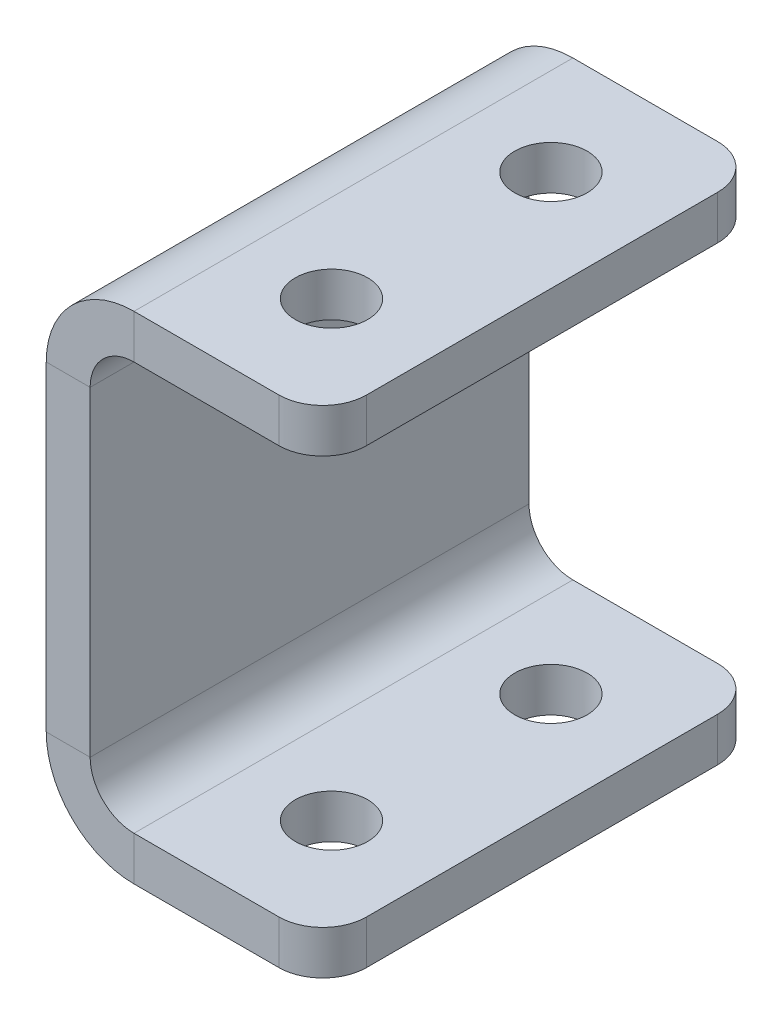
ISO-10303-21;
HEADER;
FILE_DESCRIPTION(('STEP AP214'),'2;1');
FILE_NAME('part.step','',(''),(''),'','','');
FILE_SCHEMA(('AUTOMOTIVE_DESIGN { 1 0 10303 214 1 1 1 1 }'));
ENDSEC;
DATA;
#1=APPLICATION_CONTEXT('core data for automotive mechanical design processes');
#2=APPLICATION_PROTOCOL_DEFINITION('international standard','automotive_design',2000,#1);
#3=PRODUCT_CONTEXT('',#1,'mechanical');
#4=PRODUCT('Part','Part','',(#3));
#5=PRODUCT_RELATED_PRODUCT_CATEGORY('part','',(#4));
#6=PRODUCT_DEFINITION_FORMATION('','',#4);
#7=PRODUCT_DEFINITION_CONTEXT('part definition',#1,'design');
#8=PRODUCT_DEFINITION('design','',#6,#7);
#9=PRODUCT_DEFINITION_SHAPE('','',#8);
#10=(LENGTH_UNIT() NAMED_UNIT(*) SI_UNIT(.MILLI.,.METRE.));
#11=(NAMED_UNIT(*) PLANE_ANGLE_UNIT() SI_UNIT($,.RADIAN.));
#12=(NAMED_UNIT(*) SI_UNIT($,.STERADIAN.) SOLID_ANGLE_UNIT());
#13=UNCERTAINTY_MEASURE_WITH_UNIT(LENGTH_MEASURE(1.E-05),#10,'distance_accuracy_value','');
#14=(GEOMETRIC_REPRESENTATION_CONTEXT(3) GLOBAL_UNCERTAINTY_ASSIGNED_CONTEXT((#13)) GLOBAL_UNIT_ASSIGNED_CONTEXT((#10,
#11,#12)) REPRESENTATION_CONTEXT('',''));
#15=CARTESIAN_POINT('',(0.,0.,0.));
#16=DIRECTION('',(0.,0.,1.));
#17=DIRECTION('',(1.,0.,0.));
#18=AXIS2_PLACEMENT_3D('',#15,#16,#17);
#19=CARTESIAN_POINT('',(0.,-36.5,50.));
#20=DIRECTION('',(0.,0.,1.));
#21=DIRECTION('',(1.,0.,0.));
#22=AXIS2_PLACEMENT_3D('',#19,#20,#21);
#23=PLANE('',#22);
#24=DIRECTION('',(1.,0.,0.));
#25=VECTOR('',#24,1.);
#26=CARTESIAN_POINT('',(0.,-36.5,50.));
#27=LINE('',#26,#25);
#28=CARTESIAN_POINT('',(0.,-36.5,50.));
#29=VERTEX_POINT('',#28);
#30=CARTESIAN_POINT('',(10.,-36.5,50.));
#31=VERTEX_POINT('',#30);
#32=EDGE_CURVE('E274',#29,#31,#27,.T.);
#33=ORIENTED_EDGE('',*,*,#32,.F.);
#34=CARTESIAN_POINT('',(20.,-36.5,50.));
#35=DIRECTION('',(0.,0.,1.));
#36=DIRECTION('',(1.,0.,0.));
#37=AXIS2_PLACEMENT_3D('',#34,#35,#36);
#38=CIRCLE('',#37,20.);
#39=CARTESIAN_POINT('',(20.,-56.5,50.));
#40=VERTEX_POINT('',#39);
#41=EDGE_CURVE('E191',#40,#29,#38,.F.);
#42=ORIENTED_EDGE('',*,*,#41,.F.);
#43=DIRECTION('',(0.,-1.,0.));
#44=VECTOR('',#43,1.);
#45=CARTESIAN_POINT('',(20.,-46.5,50.));
#46=LINE('',#45,#44);
#47=CARTESIAN_POINT('',(20.,-46.5,50.));
#48=VERTEX_POINT('',#47);
#49=EDGE_CURVE('E271',#48,#40,#46,.T.);
#50=ORIENTED_EDGE('',*,*,#49,.F.);
#51=CARTESIAN_POINT('',(20.,-36.5,50.));
#52=DIRECTION('',(0.,0.,1.));
#53=DIRECTION('',(1.,0.,0.));
#54=AXIS2_PLACEMENT_3D('',#51,#52,#53);
#55=CIRCLE('',#54,10.);
#56=EDGE_CURVE('E201',#48,#31,#55,.F.);
#57=ORIENTED_EDGE('',*,*,#56,.T.);
#58=EDGE_LOOP('',(#33,#42,#50,#57));
#59=FACE_BOUND('',#58,.T.);
#60=ADVANCED_FACE('F41',(#59),#23,.T.);
#61=CARTESIAN_POINT('',(20.,-46.5,50.));
#62=DIRECTION('',(0.,0.,1.));
#63=DIRECTION('',(1.,0.,0.));
#64=AXIS2_PLACEMENT_3D('',#61,#62,#63);
#65=PLANE('',#64);
#66=DIRECTION('',(0.,1.,0.));
#67=VECTOR('',#66,1.);
#68=CARTESIAN_POINT('',(0.,56.5,50.));
#69=LINE('',#68,#67);
#70=CARTESIAN_POINT('',(0.,36.5,50.));
#71=VERTEX_POINT('',#70);
#72=EDGE_CURVE('E189',#29,#71,#69,.T.);
#73=ORIENTED_EDGE('',*,*,#72,.F.);
#74=ORIENTED_EDGE('',*,*,#32,.T.);
#75=DIRECTION('',(0.,1.,0.));
#76=VECTOR('',#75,1.);
#77=CARTESIAN_POINT('',(9.99999999999998,56.5,50.));
#78=LINE('',#77,#76);
#79=CARTESIAN_POINT('',(9.99999999999998,36.5,50.));
#80=VERTEX_POINT('',#79);
#81=EDGE_CURVE('E204',#31,#80,#78,.T.);
#82=ORIENTED_EDGE('',*,*,#81,.T.);
#83=DIRECTION('',(-1.,0.,0.));
#84=VECTOR('',#83,1.);
#85=CARTESIAN_POINT('',(9.99999999999998,36.5,50.));
#86=LINE('',#85,#84);
#87=EDGE_CURVE('E166',#80,#71,#86,.T.);
#88=ORIENTED_EDGE('',*,*,#87,.T.);
#89=EDGE_LOOP('',(#73,#74,#82,#88));
#90=FACE_BOUND('',#89,.T.);
#91=ADVANCED_FACE('F427',(#90),#65,.T.);
#92=CARTESIAN_POINT('',(20.,-56.5,-50.));
#93=DIRECTION('',(0.,0.,-1.));
#94=DIRECTION('',(-1.,0.,0.));
#95=AXIS2_PLACEMENT_3D('',#92,#93,#94);
#96=PLANE('',#95);
#97=DIRECTION('',(0.,1.,0.));
#98=VECTOR('',#97,1.);
#99=CARTESIAN_POINT('',(20.,-56.5,-50.));
#100=LINE('',#99,#98);
#101=CARTESIAN_POINT('',(20.,-56.5,-50.));
#102=VERTEX_POINT('',#101);
#103=CARTESIAN_POINT('',(20.,-46.5,-50.));
#104=VERTEX_POINT('',#103);
#105=EDGE_CURVE('E268',#102,#104,#100,.T.);
#106=ORIENTED_EDGE('',*,*,#105,.F.);
#107=CARTESIAN_POINT('',(20.,-36.5,-50.));
#108=DIRECTION('',(0.,0.,1.));
#109=DIRECTION('',(1.,0.,0.));
#110=AXIS2_PLACEMENT_3D('',#107,#108,#109);
#111=CIRCLE('',#110,20.);
#112=CARTESIAN_POINT('',(0.,-36.5,-50.));
#113=VERTEX_POINT('',#112);
#114=EDGE_CURVE('E219',#102,#113,#111,.F.);
#115=ORIENTED_EDGE('',*,*,#114,.T.);
#116=DIRECTION('',(-1.,0.,0.));
#117=VECTOR('',#116,1.);
#118=CARTESIAN_POINT('',(10.,-36.5,-50.));
#119=LINE('',#118,#117);
#120=CARTESIAN_POINT('',(10.,-36.5,-50.));
#121=VERTEX_POINT('',#120);
#122=EDGE_CURVE('E165',#121,#113,#119,.T.);
#123=ORIENTED_EDGE('',*,*,#122,.F.);
#124=CARTESIAN_POINT('',(20.,-36.5,-50.));
#125=DIRECTION('',(0.,0.,1.));
#126=DIRECTION('',(1.,0.,0.));
#127=AXIS2_PLACEMENT_3D('',#124,#125,#126);
#128=CIRCLE('',#127,10.);
#129=EDGE_CURVE('E226',#104,#121,#128,.F.);
#130=ORIENTED_EDGE('',*,*,#129,.F.);
#131=EDGE_LOOP('',(#106,#115,#123,#130));
#132=FACE_BOUND('',#131,.T.);
#133=ADVANCED_FACE('F393',(#132),#96,.T.);
#134=CARTESIAN_POINT('',(10.,-36.5,-50.));
#135=DIRECTION('',(0.,0.,-1.));
#136=DIRECTION('',(-1.,0.,0.));
#137=AXIS2_PLACEMENT_3D('',#134,#135,#136);
#138=PLANE('',#137);
#139=DIRECTION('',(-1.,0.,0.));
#140=VECTOR('',#139,1.);
#141=CARTESIAN_POINT('',(0.,-46.5,-50.));
#142=LINE('',#141,#140);
#143=CARTESIAN_POINT('',(53.,-46.5,-50.));
#144=VERTEX_POINT('',#143);
#145=EDGE_CURVE('E224',#144,#104,#142,.T.);
#146=ORIENTED_EDGE('',*,*,#145,.F.);
#147=DIRECTION('',(0.,-1.,0.));
#148=VECTOR('',#147,1.);
#149=CARTESIAN_POINT('',(53.,-36.5000000000001,-50.));
#150=LINE('',#149,#148);
#151=CARTESIAN_POINT('',(53.,-56.5,-50.));
#152=VERTEX_POINT('',#151);
#153=EDGE_CURVE('E300',#144,#152,#150,.T.);
#154=ORIENTED_EDGE('',*,*,#153,.T.);
#155=DIRECTION('',(-1.,0.,0.));
#156=VECTOR('',#155,1.);
#157=CARTESIAN_POINT('',(0.,-56.5,-50.));
#158=LINE('',#157,#156);
#159=EDGE_CURVE('E222',#152,#102,#158,.T.);
#160=ORIENTED_EDGE('',*,*,#159,.T.);
#161=ORIENTED_EDGE('',*,*,#105,.T.);
#162=EDGE_LOOP('',(#146,#154,#160,#161));
#163=FACE_BOUND('',#162,.T.);
#164=ADVANCED_FACE('F387',(#163),#138,.T.);
#165=CARTESIAN_POINT('',(20.,56.5,50.));
#166=DIRECTION('',(0.,0.,1.));
#167=DIRECTION('',(1.,0.,0.));
#168=AXIS2_PLACEMENT_3D('',#165,#166,#167);
#169=PLANE('',#168);
#170=DIRECTION('',(0.,-1.,0.));
#171=VECTOR('',#170,1.);
#172=CARTESIAN_POINT('',(20.,56.5,50.));
#173=LINE('',#172,#171);
#174=CARTESIAN_POINT('',(20.,56.5,50.));
#175=VERTEX_POINT('',#174);
#176=CARTESIAN_POINT('',(20.,46.5,50.));
#177=VERTEX_POINT('',#176);
#178=EDGE_CURVE('E156',#175,#177,#173,.T.);
#179=ORIENTED_EDGE('',*,*,#178,.F.);
#180=CARTESIAN_POINT('',(20.,36.5,50.));
#181=DIRECTION('',(0.,0.,1.));
#182=DIRECTION('',(1.,0.,0.));
#183=AXIS2_PLACEMENT_3D('',#180,#181,#182);
#184=CIRCLE('',#183,20.);
#185=EDGE_CURVE('E160',#71,#175,#184,.F.);
#186=ORIENTED_EDGE('',*,*,#185,.F.);
#187=ORIENTED_EDGE('',*,*,#87,.F.);
#188=CARTESIAN_POINT('',(20.,36.5,50.));
#189=DIRECTION('',(0.,0.,1.));
#190=DIRECTION('',(1.,0.,0.));
#191=AXIS2_PLACEMENT_3D('',#188,#189,#190);
#192=CIRCLE('',#191,10.);
#193=EDGE_CURVE('E163',#80,#177,#192,.F.);
#194=ORIENTED_EDGE('',*,*,#193,.T.);
#195=EDGE_LOOP('',(#179,#186,#187,#194));
#196=FACE_BOUND('',#195,.T.);
#197=ADVANCED_FACE('F158',(#196),#169,.T.);
#198=CARTESIAN_POINT('',(9.99999999999998,36.5,50.));
#199=DIRECTION('',(0.,0.,1.));
#200=DIRECTION('',(1.,0.,0.));
#201=AXIS2_PLACEMENT_3D('',#198,#199,#200);
#202=PLANE('',#201);
#203=DIRECTION('',(1.,0.,0.));
#204=VECTOR('',#203,1.);
#205=CARTESIAN_POINT('',(0.,46.5,50.));
#206=LINE('',#205,#204);
#207=CARTESIAN_POINT('',(53.,46.5,50.));
#208=VERTEX_POINT('',#207);
#209=EDGE_CURVE('E184',#177,#208,#206,.T.);
#210=ORIENTED_EDGE('',*,*,#209,.T.);
#211=DIRECTION('',(0.,-1.,0.));
#212=VECTOR('',#211,1.);
#213=CARTESIAN_POINT('',(53.,36.5000000000001,50.));
#214=LINE('',#213,#212);
#215=CARTESIAN_POINT('',(53.,56.5,50.));
#216=VERTEX_POINT('',#215);
#217=EDGE_CURVE('E11',#208,#216,#214,.F.);
#218=ORIENTED_EDGE('',*,*,#217,.T.);
#219=DIRECTION('',(1.,0.,0.));
#220=VECTOR('',#219,1.);
#221=CARTESIAN_POINT('',(0.,56.5,50.));
#222=LINE('',#221,#220);
#223=EDGE_CURVE('E173',#175,#216,#222,.T.);
#224=ORIENTED_EDGE('',*,*,#223,.F.);
#225=ORIENTED_EDGE('',*,*,#178,.T.);
#226=EDGE_LOOP('',(#210,#218,#224,#225));
#227=FACE_BOUND('',#226,.T.);
#228=ADVANCED_FACE('F183',(#227),#202,.T.);
#229=CARTESIAN_POINT('',(0.,36.5,-50.));
#230=DIRECTION('',(0.,0.,-1.));
#231=DIRECTION('',(-1.,0.,0.));
#232=AXIS2_PLACEMENT_3D('',#229,#230,#231);
#233=PLANE('',#232);
#234=DIRECTION('',(1.,0.,0.));
#235=VECTOR('',#234,1.);
#236=CARTESIAN_POINT('',(0.,36.5,-50.));
#237=LINE('',#236,#235);
#238=CARTESIAN_POINT('',(0.,36.5,-50.));
#239=VERTEX_POINT('',#238);
#240=CARTESIAN_POINT('',(9.99999999999998,36.5,-50.));
#241=VERTEX_POINT('',#240);
#242=EDGE_CURVE('E264',#239,#241,#237,.T.);
#243=ORIENTED_EDGE('',*,*,#242,.F.);
#244=CARTESIAN_POINT('',(20.,36.5,-50.));
#245=DIRECTION('',(0.,0.,1.));
#246=DIRECTION('',(1.,0.,0.));
#247=AXIS2_PLACEMENT_3D('',#244,#245,#246);
#248=CIRCLE('',#247,20.);
#249=CARTESIAN_POINT('',(20.,56.5,-50.));
#250=VERTEX_POINT('',#249);
#251=EDGE_CURVE('E214',#239,#250,#248,.F.);
#252=ORIENTED_EDGE('',*,*,#251,.T.);
#253=DIRECTION('',(0.,1.,0.));
#254=VECTOR('',#253,1.);
#255=CARTESIAN_POINT('',(20.,46.5,-50.));
#256=LINE('',#255,#254);
#257=CARTESIAN_POINT('',(20.,46.5,-50.));
#258=VERTEX_POINT('',#257);
#259=EDGE_CURVE('E262',#258,#250,#256,.T.);
#260=ORIENTED_EDGE('',*,*,#259,.F.);
#261=CARTESIAN_POINT('',(20.,36.5,-50.));
#262=DIRECTION('',(0.,0.,1.));
#263=DIRECTION('',(1.,0.,0.));
#264=AXIS2_PLACEMENT_3D('',#261,#262,#263);
#265=CIRCLE('',#264,10.);
#266=EDGE_CURVE('E232',#241,#258,#265,.F.);
#267=ORIENTED_EDGE('',*,*,#266,.F.);
#268=EDGE_LOOP('',(#243,#252,#260,#267));
#269=FACE_BOUND('',#268,.T.);
#270=ADVANCED_FACE('F408',(#269),#233,.T.);
#271=CARTESIAN_POINT('',(20.,46.5,-50.));
#272=DIRECTION('',(0.,0.,-1.));
#273=DIRECTION('',(-1.,0.,0.));
#274=AXIS2_PLACEMENT_3D('',#271,#272,#273);
#275=PLANE('',#274);
#276=DIRECTION('',(0.,1.,0.));
#277=VECTOR('',#276,1.);
#278=CARTESIAN_POINT('',(0.,56.5,-50.));
#279=LINE('',#278,#277);
#280=EDGE_CURVE('E216',#113,#239,#279,.T.);
#281=ORIENTED_EDGE('',*,*,#280,.T.);
#282=ORIENTED_EDGE('',*,*,#242,.T.);
#283=DIRECTION('',(0.,1.,0.));
#284=VECTOR('',#283,1.);
#285=CARTESIAN_POINT('',(9.99999999999998,56.5,-50.));
#286=LINE('',#285,#284);
#287=EDGE_CURVE('E229',#121,#241,#286,.T.);
#288=ORIENTED_EDGE('',*,*,#287,.F.);
#289=ORIENTED_EDGE('',*,*,#122,.T.);
#290=EDGE_LOOP('',(#281,#282,#288,#289));
#291=FACE_BOUND('',#290,.T.);
#292=ADVANCED_FACE('F397',(#291),#275,.T.);
#293=CARTESIAN_POINT('',(0.,46.5,50.));
#294=DIRECTION('',(0.,1.,0.));
#295=DIRECTION('',(-1.,0.,0.));
#296=AXIS2_PLACEMENT_3D('',#293,#294,#295);
#297=PLANE('',#296);
#298=CARTESIAN_POINT('',(40.,46.5,25.));
#299=DIRECTION('',(0.,1.,0.));
#300=DIRECTION('',(-1.,0.,0.));
#301=AXIS2_PLACEMENT_3D('',#298,#299,#300);
#302=CIRCLE('',#301,8.25);
#303=CARTESIAN_POINT('',(31.75,46.5,25.));
#304=VERTEX_POINT('',#303);
#305=EDGE_CURVE('E284',#304,#304,#302,.T.);
#306=ORIENTED_EDGE('',*,*,#305,.T.);
#307=EDGE_LOOP('',(#306));
#308=FACE_BOUND('',#307,.T.);
#309=CARTESIAN_POINT('',(40.,46.5,-25.));
#310=DIRECTION('',(0.,1.,0.));
#311=DIRECTION('',(-1.,0.,0.));
#312=AXIS2_PLACEMENT_3D('',#309,#310,#311);
#313=CIRCLE('',#312,8.25);
#314=CARTESIAN_POINT('',(31.75,46.5,-25.));
#315=VERTEX_POINT('',#314);
#316=EDGE_CURVE('E212',#315,#315,#313,.T.);
#317=ORIENTED_EDGE('',*,*,#316,.T.);
#318=EDGE_LOOP('',(#317));
#319=FACE_BOUND('',#318,.T.);
#320=DIRECTION('',(1.,0.,0.));
#321=VECTOR('',#320,1.);
#322=CARTESIAN_POINT('',(0.,46.5,-50.));
#323=LINE('',#322,#321);
#324=CARTESIAN_POINT('',(53.,46.5,-50.));
#325=VERTEX_POINT('',#324);
#326=EDGE_CURVE('E209',#258,#325,#323,.T.);
#327=ORIENTED_EDGE('',*,*,#326,.T.);
#328=CARTESIAN_POINT('',(53.,46.5,-40.));
#329=DIRECTION('',(0.,1.,0.));
#330=DIRECTION('',(-1.,0.,0.));
#331=AXIS2_PLACEMENT_3D('',#328,#329,#330);
#332=CIRCLE('',#331,10.);
#333=CARTESIAN_POINT('',(63.,46.5,-40.));
#334=VERTEX_POINT('',#333);
#335=EDGE_CURVE('E308',#325,#334,#332,.F.);
#336=ORIENTED_EDGE('',*,*,#335,.T.);
#337=DIRECTION('',(0.,0.,-1.));
#338=VECTOR('',#337,1.);
#339=CARTESIAN_POINT('',(63.,46.5,50.));
#340=LINE('',#339,#338);
#341=CARTESIAN_POINT('',(63.,46.5,40.));
#342=VERTEX_POINT('',#341);
#343=EDGE_CURVE('E260',#342,#334,#340,.T.);
#344=ORIENTED_EDGE('',*,*,#343,.F.);
#345=CARTESIAN_POINT('',(53.,46.5,40.));
#346=DIRECTION('',(0.,1.,0.));
#347=DIRECTION('',(-1.,0.,0.));
#348=AXIS2_PLACEMENT_3D('',#345,#346,#347);
#349=CIRCLE('',#348,10.);
#350=EDGE_CURVE('E306',#342,#208,#349,.F.);
#351=ORIENTED_EDGE('',*,*,#350,.T.);
#352=ORIENTED_EDGE('',*,*,#209,.F.);
#353=DIRECTION('',(0.,0.,-1.));
#354=VECTOR('',#353,1.);
#355=CARTESIAN_POINT('',(20.,46.5,50.));
#356=LINE('',#355,#354);
#357=EDGE_CURVE('E208',#177,#258,#356,.T.);
#358=ORIENTED_EDGE('',*,*,#357,.T.);
#359=EDGE_LOOP('',(#327,#336,#344,#351,#352,#358));
#360=FACE_BOUND('',#359,.T.);
#361=ADVANCED_FACE('F324',(#308,#319,#360),#297,.F.);
#362=CARTESIAN_POINT('',(63.,56.5,50.));
#363=DIRECTION('',(1.,0.,0.));
#364=DIRECTION('',(0.,1.,0.));
#365=AXIS2_PLACEMENT_3D('',#362,#363,#364);
#366=PLANE('',#365);
#367=ORIENTED_EDGE('',*,*,#343,.T.);
#368=DIRECTION('',(0.,-1.,0.));
#369=VECTOR('',#368,1.);
#370=CARTESIAN_POINT('',(63.,56.5,-40.));
#371=LINE('',#370,#369);
#372=CARTESIAN_POINT('',(63.,56.5,-40.));
#373=VERTEX_POINT('',#372);
#374=EDGE_CURVE('E62',#334,#373,#371,.F.);
#375=ORIENTED_EDGE('',*,*,#374,.T.);
#376=DIRECTION('',(0.,0.,-1.));
#377=VECTOR('',#376,1.);
#378=CARTESIAN_POINT('',(63.,56.5,50.));
#379=LINE('',#378,#377);
#380=CARTESIAN_POINT('',(63.,56.5,40.));
#381=VERTEX_POINT('',#380);
#382=EDGE_CURVE('E180',#381,#373,#379,.T.);
#383=ORIENTED_EDGE('',*,*,#382,.F.);
#384=DIRECTION('',(0.,-1.,0.));
#385=VECTOR('',#384,1.);
#386=CARTESIAN_POINT('',(63.,56.5,40.));
#387=LINE('',#386,#385);
#388=EDGE_CURVE('E310',#381,#342,#387,.T.);
#389=ORIENTED_EDGE('',*,*,#388,.T.);
#390=EDGE_LOOP('',(#367,#375,#383,#389));
#391=FACE_BOUND('',#390,.T.);
#392=ADVANCED_FACE('F325',(#391),#366,.T.);
#393=CARTESIAN_POINT('',(0.,56.5,50.));
#394=DIRECTION('',(0.,1.,0.));
#395=DIRECTION('',(-1.,0.,0.));
#396=AXIS2_PLACEMENT_3D('',#393,#394,#395);
#397=PLANE('',#396);
#398=CARTESIAN_POINT('',(40.,56.5,25.));
#399=DIRECTION('',(0.,1.,0.));
#400=DIRECTION('',(-1.,0.,0.));
#401=AXIS2_PLACEMENT_3D('',#398,#399,#400);
#402=CIRCLE('',#401,8.25);
#403=CARTESIAN_POINT('',(31.75,56.5,25.));
#404=VERTEX_POINT('',#403);
#405=EDGE_CURVE('E339',#404,#404,#402,.T.);
#406=ORIENTED_EDGE('',*,*,#405,.F.);
#407=EDGE_LOOP('',(#406));
#408=FACE_BOUND('',#407,.T.);
#409=CARTESIAN_POINT('',(40.,56.5,-25.));
#410=DIRECTION('',(0.,1.,0.));
#411=DIRECTION('',(-1.,0.,0.));
#412=AXIS2_PLACEMENT_3D('',#409,#410,#411);
#413=CIRCLE('',#412,8.25);
#414=CARTESIAN_POINT('',(31.75,56.5,-25.));
#415=VERTEX_POINT('',#414);
#416=EDGE_CURVE('E332',#415,#415,#413,.T.);
#417=ORIENTED_EDGE('',*,*,#416,.F.);
#418=EDGE_LOOP('',(#417));
#419=FACE_BOUND('',#418,.T.);
#420=ORIENTED_EDGE('',*,*,#382,.T.);
#421=CARTESIAN_POINT('',(53.,56.5,-40.));
#422=DIRECTION('',(0.,1.,0.));
#423=DIRECTION('',(-1.,0.,0.));
#424=AXIS2_PLACEMENT_3D('',#421,#422,#423);
#425=CIRCLE('',#424,10.);
#426=CARTESIAN_POINT('',(53.,56.5,-50.));
#427=VERTEX_POINT('',#426);
#428=EDGE_CURVE('E49',#373,#427,#425,.T.);
#429=ORIENTED_EDGE('',*,*,#428,.T.);
#430=DIRECTION('',(1.,0.,0.));
#431=VECTOR('',#430,1.);
#432=CARTESIAN_POINT('',(0.,56.5,-50.));
#433=LINE('',#432,#431);
#434=EDGE_CURVE('E176',#250,#427,#433,.T.);
#435=ORIENTED_EDGE('',*,*,#434,.F.);
#436=DIRECTION('',(0.,0.,-1.));
#437=VECTOR('',#436,1.);
#438=CARTESIAN_POINT('',(20.,56.5,50.));
#439=LINE('',#438,#437);
#440=EDGE_CURVE('E171',#175,#250,#439,.T.);
#441=ORIENTED_EDGE('',*,*,#440,.F.);
#442=ORIENTED_EDGE('',*,*,#223,.T.);
#443=CARTESIAN_POINT('',(53.,56.5,40.));
#444=DIRECTION('',(0.,1.,0.));
#445=DIRECTION('',(-1.,0.,0.));
#446=AXIS2_PLACEMENT_3D('',#443,#444,#445);
#447=CIRCLE('',#446,10.);
#448=EDGE_CURVE('E314',#216,#381,#447,.T.);
#449=ORIENTED_EDGE('',*,*,#448,.T.);
#450=EDGE_LOOP('',(#420,#429,#435,#441,#442,#449));
#451=FACE_BOUND('',#450,.T.);
#452=ADVANCED_FACE('F172',(#408,#419,#451),#397,.T.);
#453=CARTESIAN_POINT('',(20.,36.5,50.));
#454=DIRECTION('',(0.,0.,-1.));
#455=DIRECTION('',(-1.,0.,0.));
#456=AXIS2_PLACEMENT_3D('',#453,#454,#455);
#457=CYLINDRICAL_SURFACE('',#456,20.);
#458=ORIENTED_EDGE('',*,*,#251,.F.);
#459=DIRECTION('',(0.,0.,-1.));
#460=VECTOR('',#459,1.);
#461=CARTESIAN_POINT('',(0.,36.5,50.));
#462=LINE('',#461,#460);
#463=EDGE_CURVE('E181',#71,#239,#462,.T.);
#464=ORIENTED_EDGE('',*,*,#463,.F.);
#465=ORIENTED_EDGE('',*,*,#185,.T.);
#466=ORIENTED_EDGE('',*,*,#440,.T.);
#467=EDGE_LOOP('',(#458,#464,#465,#466));
#468=FACE_BOUND('',#467,.T.);
#469=ADVANCED_FACE('F187',(#468),#457,.T.);
#470=CARTESIAN_POINT('',(0.,56.5,50.));
#471=DIRECTION('',(-1.,0.,0.));
#472=DIRECTION('',(0.,-1.,0.));
#473=AXIS2_PLACEMENT_3D('',#470,#471,#472);
#474=PLANE('',#473);
#475=ORIENTED_EDGE('',*,*,#280,.F.);
#476=DIRECTION('',(0.,0.,-1.));
#477=VECTOR('',#476,1.);
#478=CARTESIAN_POINT('',(0.,-36.5,50.));
#479=LINE('',#478,#477);
#480=EDGE_CURVE('E255',#29,#113,#479,.T.);
#481=ORIENTED_EDGE('',*,*,#480,.F.);
#482=ORIENTED_EDGE('',*,*,#72,.T.);
#483=ORIENTED_EDGE('',*,*,#463,.T.);
#484=EDGE_LOOP('',(#475,#481,#482,#483));
#485=FACE_BOUND('',#484,.T.);
#486=ADVANCED_FACE('F406',(#485),#474,.T.);
#487=CARTESIAN_POINT('',(20.,-36.5,50.));
#488=DIRECTION('',(0.,0.,-1.));
#489=DIRECTION('',(-1.,0.,0.));
#490=AXIS2_PLACEMENT_3D('',#487,#488,#489);
#491=CYLINDRICAL_SURFACE('',#490,20.);
#492=ORIENTED_EDGE('',*,*,#114,.F.);
#493=DIRECTION('',(0.,0.,-1.));
#494=VECTOR('',#493,1.);
#495=CARTESIAN_POINT('',(20.,-56.5,50.));
#496=LINE('',#495,#494);
#497=EDGE_CURVE('E252',#40,#102,#496,.T.);
#498=ORIENTED_EDGE('',*,*,#497,.F.);
#499=ORIENTED_EDGE('',*,*,#41,.T.);
#500=ORIENTED_EDGE('',*,*,#480,.T.);
#501=EDGE_LOOP('',(#492,#498,#499,#500));
#502=FACE_BOUND('',#501,.T.);
#503=ADVANCED_FACE('F401',(#502),#491,.T.);
#504=CARTESIAN_POINT('',(0.,-56.5,50.));
#505=DIRECTION('',(0.,-1.,0.));
#506=DIRECTION('',(1.,0.,0.));
#507=AXIS2_PLACEMENT_3D('',#504,#505,#506);
#508=PLANE('',#507);
#509=CARTESIAN_POINT('',(40.,-56.5,25.));
#510=DIRECTION('',(0.,1.,0.));
#511=DIRECTION('',(-1.,0.,0.));
#512=AXIS2_PLACEMENT_3D('',#509,#510,#511);
#513=CIRCLE('',#512,8.25);
#514=CARTESIAN_POINT('',(31.75,-56.5,25.));
#515=VERTEX_POINT('',#514);
#516=EDGE_CURVE('E285',#515,#515,#513,.T.);
#517=ORIENTED_EDGE('',*,*,#516,.T.);
#518=EDGE_LOOP('',(#517));
#519=FACE_BOUND('',#518,.T.);
#520=CARTESIAN_POINT('',(40.,-56.5,-25.));
#521=DIRECTION('',(0.,1.,0.));
#522=DIRECTION('',(-1.,0.,0.));
#523=AXIS2_PLACEMENT_3D('',#520,#521,#522);
#524=CIRCLE('',#523,8.25);
#525=CARTESIAN_POINT('',(31.75,-56.5,-25.));
#526=VERTEX_POINT('',#525);
#527=EDGE_CURVE('E280',#526,#526,#524,.T.);
#528=ORIENTED_EDGE('',*,*,#527,.T.);
#529=EDGE_LOOP('',(#528));
#530=FACE_BOUND('',#529,.T.);
#531=DIRECTION('',(0.,0.,-1.));
#532=VECTOR('',#531,1.);
#533=CARTESIAN_POINT('',(63.,-56.5,50.));
#534=LINE('',#533,#532);
#535=CARTESIAN_POINT('',(63.,-56.5,40.));
#536=VERTEX_POINT('',#535);
#537=CARTESIAN_POINT('',(63.,-56.5,-40.));
#538=VERTEX_POINT('',#537);
#539=EDGE_CURVE('E249',#536,#538,#534,.T.);
#540=ORIENTED_EDGE('',*,*,#539,.F.);
#541=CARTESIAN_POINT('',(53.,-56.5,40.));
#542=DIRECTION('',(0.,-1.,0.));
#543=DIRECTION('',(1.,0.,0.));
#544=AXIS2_PLACEMENT_3D('',#541,#542,#543);
#545=CIRCLE('',#544,10.);
#546=CARTESIAN_POINT('',(53.,-56.5,50.));
#547=VERTEX_POINT('',#546);
#548=EDGE_CURVE('E292',#536,#547,#545,.T.);
#549=ORIENTED_EDGE('',*,*,#548,.T.);
#550=DIRECTION('',(-1.,0.,0.));
#551=VECTOR('',#550,1.);
#552=CARTESIAN_POINT('',(0.,-56.5,50.));
#553=LINE('',#552,#551);
#554=EDGE_CURVE('E197',#547,#40,#553,.T.);
#555=ORIENTED_EDGE('',*,*,#554,.T.);
#556=ORIENTED_EDGE('',*,*,#497,.T.);
#557=ORIENTED_EDGE('',*,*,#159,.F.);
#558=CARTESIAN_POINT('',(53.,-56.5,-40.));
#559=DIRECTION('',(0.,-1.,0.));
#560=DIRECTION('',(1.,0.,0.));
#561=AXIS2_PLACEMENT_3D('',#558,#559,#560);
#562=CIRCLE('',#561,10.);
#563=EDGE_CURVE('E290',#152,#538,#562,.T.);
#564=ORIENTED_EDGE('',*,*,#563,.T.);
#565=EDGE_LOOP('',(#540,#549,#555,#556,#557,#564));
#566=FACE_BOUND('',#565,.T.);
#567=ADVANCED_FACE('F345',(#519,#530,#566),#508,.T.);
#568=CARTESIAN_POINT('',(63.,-46.5,50.));
#569=DIRECTION('',(1.,0.,0.));
#570=DIRECTION('',(0.,1.,0.));
#571=AXIS2_PLACEMENT_3D('',#568,#569,#570);
#572=PLANE('',#571);
#573=DIRECTION('',(0.,0.,-1.));
#574=VECTOR('',#573,1.);
#575=CARTESIAN_POINT('',(63.,-46.5,50.));
#576=LINE('',#575,#574);
#577=CARTESIAN_POINT('',(63.,-46.5,40.));
#578=VERTEX_POINT('',#577);
#579=CARTESIAN_POINT('',(63.,-46.5,-40.));
#580=VERTEX_POINT('',#579);
#581=EDGE_CURVE('E246',#578,#580,#576,.T.);
#582=ORIENTED_EDGE('',*,*,#581,.F.);
#583=DIRECTION('',(0.,-1.,0.));
#584=VECTOR('',#583,1.);
#585=CARTESIAN_POINT('',(63.,-46.5,40.));
#586=LINE('',#585,#584);
#587=EDGE_CURVE('E287',#578,#536,#586,.T.);
#588=ORIENTED_EDGE('',*,*,#587,.T.);
#589=ORIENTED_EDGE('',*,*,#539,.T.);
#590=DIRECTION('',(0.,-1.,0.));
#591=VECTOR('',#590,1.);
#592=CARTESIAN_POINT('',(63.,-46.5,-40.));
#593=LINE('',#592,#591);
#594=EDGE_CURVE('E276',#538,#580,#593,.F.);
#595=ORIENTED_EDGE('',*,*,#594,.T.);
#596=EDGE_LOOP('',(#582,#588,#589,#595));
#597=FACE_BOUND('',#596,.T.);
#598=ADVANCED_FACE('F360',(#597),#572,.T.);
#599=CARTESIAN_POINT('',(0.,-46.5,50.));
#600=DIRECTION('',(0.,-1.,0.));
#601=DIRECTION('',(1.,0.,0.));
#602=AXIS2_PLACEMENT_3D('',#599,#600,#601);
#603=PLANE('',#602);
#604=CARTESIAN_POINT('',(40.,-46.5,25.));
#605=DIRECTION('',(0.,-1.,0.));
#606=DIRECTION('',(1.,0.,0.));
#607=AXIS2_PLACEMENT_3D('',#604,#605,#606);
#608=CIRCLE('',#607,8.25);
#609=CARTESIAN_POINT('',(48.25,-46.5,25.));
#610=VERTEX_POINT('',#609);
#611=EDGE_CURVE('E281',#610,#610,#608,.T.);
#612=ORIENTED_EDGE('',*,*,#611,.T.);
#613=EDGE_LOOP('',(#612));
#614=FACE_BOUND('',#613,.T.);
#615=CARTESIAN_POINT('',(40.,-46.5,-25.));
#616=DIRECTION('',(0.,-1.,0.));
#617=DIRECTION('',(1.,0.,0.));
#618=AXIS2_PLACEMENT_3D('',#615,#616,#617);
#619=CIRCLE('',#618,8.25);
#620=CARTESIAN_POINT('',(48.25,-46.5,-25.));
#621=VERTEX_POINT('',#620);
#622=EDGE_CURVE('E277',#621,#621,#619,.T.);
#623=ORIENTED_EDGE('',*,*,#622,.T.);
#624=EDGE_LOOP('',(#623));
#625=FACE_BOUND('',#624,.T.);
#626=DIRECTION('',(-1.,0.,0.));
#627=VECTOR('',#626,1.);
#628=CARTESIAN_POINT('',(0.,-46.5,50.));
#629=LINE('',#628,#627);
#630=CARTESIAN_POINT('',(53.,-46.5,50.));
#631=VERTEX_POINT('',#630);
#632=EDGE_CURVE('E199',#631,#48,#629,.T.);
#633=ORIENTED_EDGE('',*,*,#632,.F.);
#634=CARTESIAN_POINT('',(53.,-46.5,40.));
#635=DIRECTION('',(0.,-1.,0.));
#636=DIRECTION('',(1.,0.,0.));
#637=AXIS2_PLACEMENT_3D('',#634,#635,#636);
#638=CIRCLE('',#637,10.);
#639=EDGE_CURVE('E298',#631,#578,#638,.F.);
#640=ORIENTED_EDGE('',*,*,#639,.T.);
#641=ORIENTED_EDGE('',*,*,#581,.T.);
#642=CARTESIAN_POINT('',(53.,-46.5,-40.));
#643=DIRECTION('',(0.,-1.,0.));
#644=DIRECTION('',(1.,0.,0.));
#645=AXIS2_PLACEMENT_3D('',#642,#643,#644);
#646=CIRCLE('',#645,10.);
#647=EDGE_CURVE('E296',#580,#144,#646,.F.);
#648=ORIENTED_EDGE('',*,*,#647,.T.);
#649=ORIENTED_EDGE('',*,*,#145,.T.);
#650=DIRECTION('',(0.,0.,-1.));
#651=VECTOR('',#650,1.);
#652=CARTESIAN_POINT('',(20.,-46.5,50.));
#653=LINE('',#652,#651);
#654=EDGE_CURVE('E243',#48,#104,#653,.T.);
#655=ORIENTED_EDGE('',*,*,#654,.F.);
#656=EDGE_LOOP('',(#633,#640,#641,#648,#649,#655));
#657=FACE_BOUND('',#656,.T.);
#658=ADVANCED_FACE('F356',(#614,#625,#657),#603,.F.);
#659=CARTESIAN_POINT('',(20.,-36.5,50.));
#660=DIRECTION('',(0.,0.,-1.));
#661=DIRECTION('',(-1.,0.,0.));
#662=AXIS2_PLACEMENT_3D('',#659,#660,#661);
#663=CYLINDRICAL_SURFACE('',#662,10.);
#664=ORIENTED_EDGE('',*,*,#129,.T.);
#665=DIRECTION('',(0.,0.,-1.));
#666=VECTOR('',#665,1.);
#667=CARTESIAN_POINT('',(10.,-36.5,50.));
#668=LINE('',#667,#666);
#669=EDGE_CURVE('E240',#31,#121,#668,.T.);
#670=ORIENTED_EDGE('',*,*,#669,.F.);
#671=ORIENTED_EDGE('',*,*,#56,.F.);
#672=ORIENTED_EDGE('',*,*,#654,.T.);
#673=EDGE_LOOP('',(#664,#670,#671,#672));
#674=FACE_BOUND('',#673,.T.);
#675=ADVANCED_FACE('F359',(#674),#663,.F.);
#676=CARTESIAN_POINT('',(9.99999999999998,56.5,50.));
#677=DIRECTION('',(-1.,0.,0.));
#678=DIRECTION('',(0.,-1.,0.));
#679=AXIS2_PLACEMENT_3D('',#676,#677,#678);
#680=PLANE('',#679);
#681=ORIENTED_EDGE('',*,*,#287,.T.);
#682=DIRECTION('',(0.,0.,-1.));
#683=VECTOR('',#682,1.);
#684=CARTESIAN_POINT('',(9.99999999999998,36.5,50.));
#685=LINE('',#684,#683);
#686=EDGE_CURVE('E237',#80,#241,#685,.T.);
#687=ORIENTED_EDGE('',*,*,#686,.F.);
#688=ORIENTED_EDGE('',*,*,#81,.F.);
#689=ORIENTED_EDGE('',*,*,#669,.T.);
#690=EDGE_LOOP('',(#681,#687,#688,#689));
#691=FACE_BOUND('',#690,.T.);
#692=ADVANCED_FACE('F412',(#691),#680,.F.);
#693=CARTESIAN_POINT('',(20.,36.5,50.));
#694=DIRECTION('',(0.,0.,-1.));
#695=DIRECTION('',(-1.,0.,0.));
#696=AXIS2_PLACEMENT_3D('',#693,#694,#695);
#697=CYLINDRICAL_SURFACE('',#696,10.);
#698=ORIENTED_EDGE('',*,*,#266,.T.);
#699=ORIENTED_EDGE('',*,*,#357,.F.);
#700=ORIENTED_EDGE('',*,*,#193,.F.);
#701=ORIENTED_EDGE('',*,*,#686,.T.);
#702=EDGE_LOOP('',(#698,#699,#700,#701));
#703=FACE_BOUND('',#702,.T.);
#704=ADVANCED_FACE('F415',(#703),#697,.F.);
#705=CARTESIAN_POINT('',(20.,36.5,50.));
#706=DIRECTION('',(0.,0.,1.));
#707=DIRECTION('',(1.,0.,0.));
#708=AXIS2_PLACEMENT_3D('',#705,#706,#707);
#709=PLANE('',#708);
#710=ORIENTED_EDGE('',*,*,#554,.F.);
#711=DIRECTION('',(0.,-1.,0.));
#712=VECTOR('',#711,1.);
#713=CARTESIAN_POINT('',(53.0000000000001,36.5,50.));
#714=LINE('',#713,#712);
#715=EDGE_CURVE('E294',#547,#631,#714,.F.);
#716=ORIENTED_EDGE('',*,*,#715,.T.);
#717=ORIENTED_EDGE('',*,*,#632,.T.);
#718=ORIENTED_EDGE('',*,*,#49,.T.);
#719=EDGE_LOOP('',(#710,#716,#717,#718));
#720=FACE_BOUND('',#719,.T.);
#721=ADVANCED_FACE('F417',(#720),#709,.T.);
#722=CARTESIAN_POINT('',(20.,36.5,-50.));
#723=DIRECTION('',(0.,0.,1.));
#724=DIRECTION('',(1.,0.,0.));
#725=AXIS2_PLACEMENT_3D('',#722,#723,#724);
#726=PLANE('',#725);
#727=ORIENTED_EDGE('',*,*,#434,.T.);
#728=DIRECTION('',(0.,-1.,0.));
#729=VECTOR('',#728,1.);
#730=CARTESIAN_POINT('',(53.,46.5,-50.));
#731=LINE('',#730,#729);
#732=EDGE_CURVE('E303',#427,#325,#731,.T.);
#733=ORIENTED_EDGE('',*,*,#732,.T.);
#734=ORIENTED_EDGE('',*,*,#326,.F.);
#735=ORIENTED_EDGE('',*,*,#259,.T.);
#736=EDGE_LOOP('',(#727,#733,#734,#735));
#737=FACE_BOUND('',#736,.T.);
#738=ADVANCED_FACE('F319',(#737),#726,.F.);
#739=CARTESIAN_POINT('',(40.,-56.5,-25.));
#740=DIRECTION('',(0.,1.,0.));
#741=DIRECTION('',(-1.,0.,0.));
#742=AXIS2_PLACEMENT_3D('',#739,#740,#741);
#743=CYLINDRICAL_SURFACE('',#742,8.25);
#744=ORIENTED_EDGE('',*,*,#527,.F.);
#745=EDGE_LOOP('',(#744));
#746=FACE_BOUND('',#745,.T.);
#747=ORIENTED_EDGE('',*,*,#622,.F.);
#748=EDGE_LOOP('',(#747));
#749=FACE_BOUND('',#748,.T.);
#750=ADVANCED_FACE('F473',(#746,#749),#743,.F.);
#751=ORIENTED_EDGE('',*,*,#416,.T.);
#752=EDGE_LOOP('',(#751));
#753=FACE_BOUND('',#752,.T.);
#754=ORIENTED_EDGE('',*,*,#316,.F.);
#755=EDGE_LOOP('',(#754));
#756=FACE_BOUND('',#755,.T.);
#757=ADVANCED_FACE('F352',(#753,#756),#743,.F.);
#758=CARTESIAN_POINT('',(40.,-56.5,25.));
#759=DIRECTION('',(0.,1.,0.));
#760=DIRECTION('',(-1.,0.,0.));
#761=AXIS2_PLACEMENT_3D('',#758,#759,#760);
#762=CYLINDRICAL_SURFACE('',#761,8.25);
#763=ORIENTED_EDGE('',*,*,#516,.F.);
#764=EDGE_LOOP('',(#763));
#765=FACE_BOUND('',#764,.T.);
#766=ORIENTED_EDGE('',*,*,#611,.F.);
#767=EDGE_LOOP('',(#766));
#768=FACE_BOUND('',#767,.T.);
#769=ADVANCED_FACE('F348',(#765,#768),#762,.F.);
#770=ORIENTED_EDGE('',*,*,#405,.T.);
#771=EDGE_LOOP('',(#770));
#772=FACE_BOUND('',#771,.T.);
#773=ORIENTED_EDGE('',*,*,#305,.F.);
#774=EDGE_LOOP('',(#773));
#775=FACE_BOUND('',#774,.T.);
#776=ADVANCED_FACE('F351',(#772,#775),#762,.F.);
#777=CARTESIAN_POINT('',(53.,-46.5,40.));
#778=DIRECTION('',(0.,-1.,0.));
#779=DIRECTION('',(1.,0.,0.));
#780=AXIS2_PLACEMENT_3D('',#777,#778,#779);
#781=CYLINDRICAL_SURFACE('',#780,10.);
#782=ORIENTED_EDGE('',*,*,#639,.F.);
#783=ORIENTED_EDGE('',*,*,#715,.F.);
#784=ORIENTED_EDGE('',*,*,#548,.F.);
#785=ORIENTED_EDGE('',*,*,#587,.F.);
#786=EDGE_LOOP('',(#782,#783,#784,#785));
#787=FACE_BOUND('',#786,.T.);
#788=ADVANCED_FACE('F374',(#787),#781,.T.);
#789=CARTESIAN_POINT('',(53.,-36.5000000000001,-40.));
#790=DIRECTION('',(0.,-1.,0.));
#791=DIRECTION('',(1.,0.,0.));
#792=AXIS2_PLACEMENT_3D('',#789,#790,#791);
#793=CYLINDRICAL_SURFACE('',#792,10.);
#794=ORIENTED_EDGE('',*,*,#647,.F.);
#795=ORIENTED_EDGE('',*,*,#594,.F.);
#796=ORIENTED_EDGE('',*,*,#563,.F.);
#797=ORIENTED_EDGE('',*,*,#153,.F.);
#798=EDGE_LOOP('',(#794,#795,#796,#797));
#799=FACE_BOUND('',#798,.T.);
#800=ADVANCED_FACE('F384',(#799),#793,.T.);
#801=CARTESIAN_POINT('',(53.,36.5000000000001,-40.));
#802=DIRECTION('',(0.,1.,0.));
#803=DIRECTION('',(-1.,0.,0.));
#804=AXIS2_PLACEMENT_3D('',#801,#802,#803);
#805=CYLINDRICAL_SURFACE('',#804,10.);
#806=ORIENTED_EDGE('',*,*,#428,.F.);
#807=ORIENTED_EDGE('',*,*,#374,.F.);
#808=ORIENTED_EDGE('',*,*,#335,.F.);
#809=ORIENTED_EDGE('',*,*,#732,.F.);
#810=EDGE_LOOP('',(#806,#807,#808,#809));
#811=FACE_BOUND('',#810,.T.);
#812=ADVANCED_FACE('F321',(#811),#805,.T.);
#813=CARTESIAN_POINT('',(53.,56.5,40.));
#814=DIRECTION('',(0.,-1.,0.));
#815=DIRECTION('',(1.,0.,0.));
#816=AXIS2_PLACEMENT_3D('',#813,#814,#815);
#817=CYLINDRICAL_SURFACE('',#816,10.);
#818=ORIENTED_EDGE('',*,*,#448,.F.);
#819=ORIENTED_EDGE('',*,*,#217,.F.);
#820=ORIENTED_EDGE('',*,*,#350,.F.);
#821=ORIENTED_EDGE('',*,*,#388,.F.);
#822=EDGE_LOOP('',(#818,#819,#820,#821));
#823=FACE_BOUND('',#822,.T.);
#824=ADVANCED_FACE('F43',(#823),#817,.T.);
#825=CLOSED_SHELL('',(#60,#91,#133,#164,#197,#228,#270,#292,#361,#392,#452,#469,#486,#503,#567,
#598,#658,#675,#692,#704,#721,#738,#750,#757,#769,#776,#788,#800,#812,#824));
#826=MANIFOLD_SOLID_BREP('B2',#825);
#827=ADVANCED_BREP_SHAPE_REPRESENTATION('',(#18,#826),#14);
#828=SHAPE_DEFINITION_REPRESENTATION(#9,#827);
ENDSEC;
END-ISO-10303-21;
